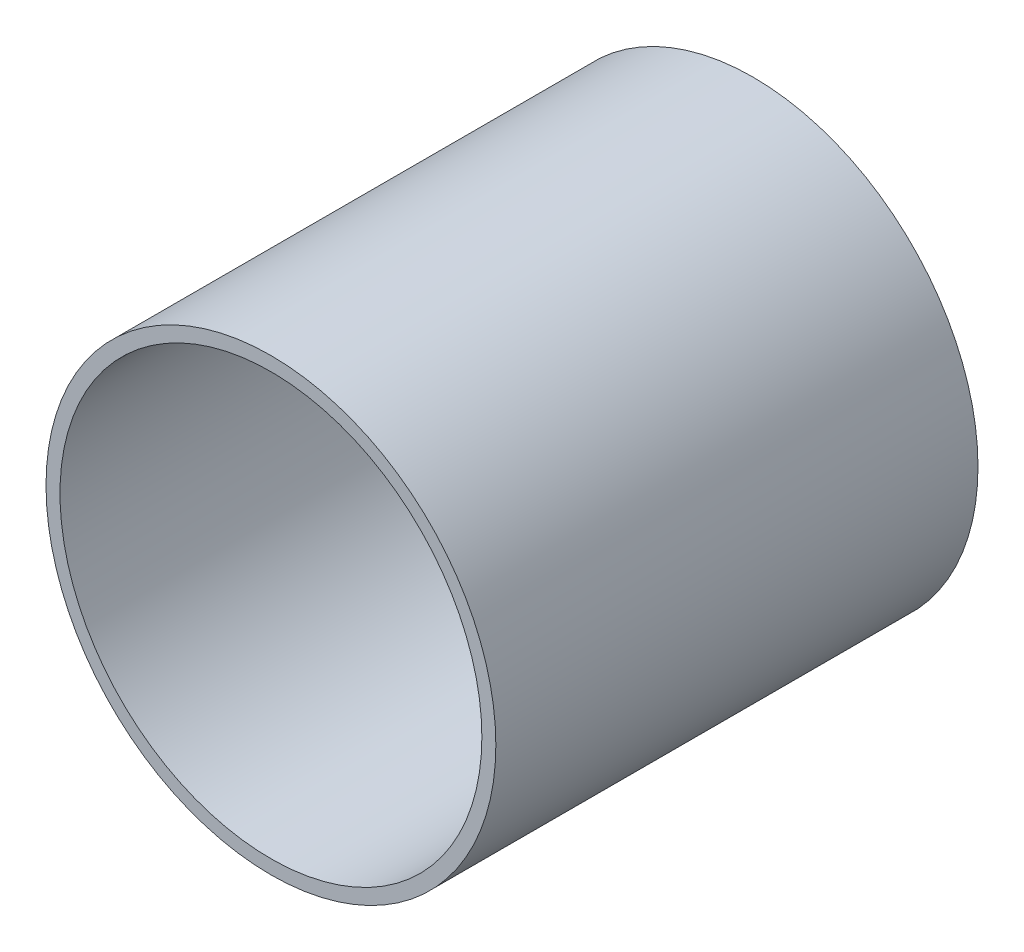
ISO-10303-21;
HEADER;
FILE_DESCRIPTION(('STEP AP214'),'2;1');
FILE_NAME('part.step','',(''),(''),'','','');
FILE_SCHEMA(('AUTOMOTIVE_DESIGN { 1 0 10303 214 1 1 1 1 }'));
ENDSEC;
DATA;
#1=APPLICATION_CONTEXT('core data for automotive mechanical design processes');
#2=APPLICATION_PROTOCOL_DEFINITION('international standard','automotive_design',2000,#1);
#3=PRODUCT_CONTEXT('',#1,'mechanical');
#4=PRODUCT('Part','Part','',(#3));
#5=PRODUCT_RELATED_PRODUCT_CATEGORY('part','',(#4));
#6=PRODUCT_DEFINITION_FORMATION('','',#4);
#7=PRODUCT_DEFINITION_CONTEXT('part definition',#1,'design');
#8=PRODUCT_DEFINITION('design','',#6,#7);
#9=PRODUCT_DEFINITION_SHAPE('','',#8);
#10=(LENGTH_UNIT() NAMED_UNIT(*) SI_UNIT(.MILLI.,.METRE.));
#11=(NAMED_UNIT(*) PLANE_ANGLE_UNIT() SI_UNIT($,.RADIAN.));
#12=(NAMED_UNIT(*) SI_UNIT($,.STERADIAN.) SOLID_ANGLE_UNIT());
#13=UNCERTAINTY_MEASURE_WITH_UNIT(LENGTH_MEASURE(1.E-05),#10,'distance_accuracy_value','');
#14=(GEOMETRIC_REPRESENTATION_CONTEXT(3) GLOBAL_UNCERTAINTY_ASSIGNED_CONTEXT((#13)) GLOBAL_UNIT_ASSIGNED_CONTEXT((#10,
#11,#12)) REPRESENTATION_CONTEXT('',''));
#15=CARTESIAN_POINT('',(0.,0.,0.));
#16=DIRECTION('',(0.,0.,1.));
#17=DIRECTION('',(1.,0.,0.));
#18=AXIS2_PLACEMENT_3D('',#15,#16,#17);
#19=CARTESIAN_POINT('',(0.,0.,50.8));
#20=DIRECTION('',(0.,0.,1.));
#21=DIRECTION('',(1.,0.,0.));
#22=AXIS2_PLACEMENT_3D('',#19,#20,#21);
#23=PLANE('',#22);
#24=CARTESIAN_POINT('',(0.,0.,50.8));
#25=DIRECTION('',(0.,0.,1.));
#26=DIRECTION('',(1.,0.,0.));
#27=AXIS2_PLACEMENT_3D('',#24,#25,#26);
#28=CIRCLE('',#27,23.6982);
#29=CARTESIAN_POINT('',(23.6982,0.,50.8));
#30=VERTEX_POINT('',#29);
#31=EDGE_CURVE('E10',#30,#30,#28,.T.);
#32=ORIENTED_EDGE('',*,*,#31,.T.);
#33=EDGE_LOOP('',(#32));
#34=FACE_BOUND('',#33,.T.);
#35=CARTESIAN_POINT('',(0.,0.,50.8));
#36=DIRECTION('',(0.,0.,1.));
#37=DIRECTION('',(1.,0.,0.));
#38=AXIS2_PLACEMENT_3D('',#35,#36,#37);
#39=CIRCLE('',#38,22.225);
#40=CARTESIAN_POINT('',(22.225,0.,50.8));
#41=VERTEX_POINT('',#40);
#42=EDGE_CURVE('E42',#41,#41,#39,.T.);
#43=ORIENTED_EDGE('',*,*,#42,.F.);
#44=EDGE_LOOP('',(#43));
#45=FACE_BOUND('',#44,.T.);
#46=ADVANCED_FACE('F31',(#34,#45),#23,.T.);
#47=CARTESIAN_POINT('',(0.,0.,0.));
#48=DIRECTION('',(0.,0.,1.));
#49=DIRECTION('',(1.,0.,0.));
#50=AXIS2_PLACEMENT_3D('',#47,#48,#49);
#51=PLANE('',#50);
#52=CARTESIAN_POINT('',(0.,0.,0.));
#53=DIRECTION('',(0.,0.,1.));
#54=DIRECTION('',(1.,0.,0.));
#55=AXIS2_PLACEMENT_3D('',#52,#53,#54);
#56=CIRCLE('',#55,23.6982);
#57=CARTESIAN_POINT('',(23.6982,0.,0.));
#58=VERTEX_POINT('',#57);
#59=EDGE_CURVE('E35',#58,#58,#56,.T.);
#60=ORIENTED_EDGE('',*,*,#59,.F.);
#61=EDGE_LOOP('',(#60));
#62=FACE_BOUND('',#61,.T.);
#63=CARTESIAN_POINT('',(0.,0.,0.));
#64=DIRECTION('',(0.,0.,1.));
#65=DIRECTION('',(1.,0.,0.));
#66=AXIS2_PLACEMENT_3D('',#63,#64,#65);
#67=CIRCLE('',#66,22.225);
#68=CARTESIAN_POINT('',(22.225,0.,0.));
#69=VERTEX_POINT('',#68);
#70=EDGE_CURVE('E44',#69,#69,#67,.T.);
#71=ORIENTED_EDGE('',*,*,#70,.T.);
#72=EDGE_LOOP('',(#71));
#73=FACE_BOUND('',#72,.T.);
#74=ADVANCED_FACE('F54',(#62,#73),#51,.F.);
#75=CARTESIAN_POINT('',(0.,0.,50.8));
#76=DIRECTION('',(0.,0.,-1.));
#77=DIRECTION('',(-1.,0.,0.));
#78=AXIS2_PLACEMENT_3D('',#75,#76,#77);
#79=CYLINDRICAL_SURFACE('',#78,23.6982);
#80=ORIENTED_EDGE('',*,*,#31,.F.);
#81=EDGE_LOOP('',(#80));
#82=FACE_BOUND('',#81,.T.);
#83=ORIENTED_EDGE('',*,*,#59,.T.);
#84=EDGE_LOOP('',(#83));
#85=FACE_BOUND('',#84,.T.);
#86=ADVANCED_FACE('F33',(#82,#85),#79,.T.);
#87=CARTESIAN_POINT('',(0.,0.,50.8));
#88=DIRECTION('',(0.,0.,-1.));
#89=DIRECTION('',(-1.,0.,0.));
#90=AXIS2_PLACEMENT_3D('',#87,#88,#89);
#91=CYLINDRICAL_SURFACE('',#90,22.225);
#92=ORIENTED_EDGE('',*,*,#42,.T.);
#93=EDGE_LOOP('',(#92));
#94=FACE_BOUND('',#93,.T.);
#95=ORIENTED_EDGE('',*,*,#70,.F.);
#96=EDGE_LOOP('',(#95));
#97=FACE_BOUND('',#96,.T.);
#98=ADVANCED_FACE('F50',(#94,#97),#91,.F.);
#99=CLOSED_SHELL('',(#46,#74,#86,#98));
#100=MANIFOLD_SOLID_BREP('B2',#99);
#101=ADVANCED_BREP_SHAPE_REPRESENTATION('',(#18,#100),#14);
#102=SHAPE_DEFINITION_REPRESENTATION(#9,#101);
ENDSEC;
END-ISO-10303-21;
